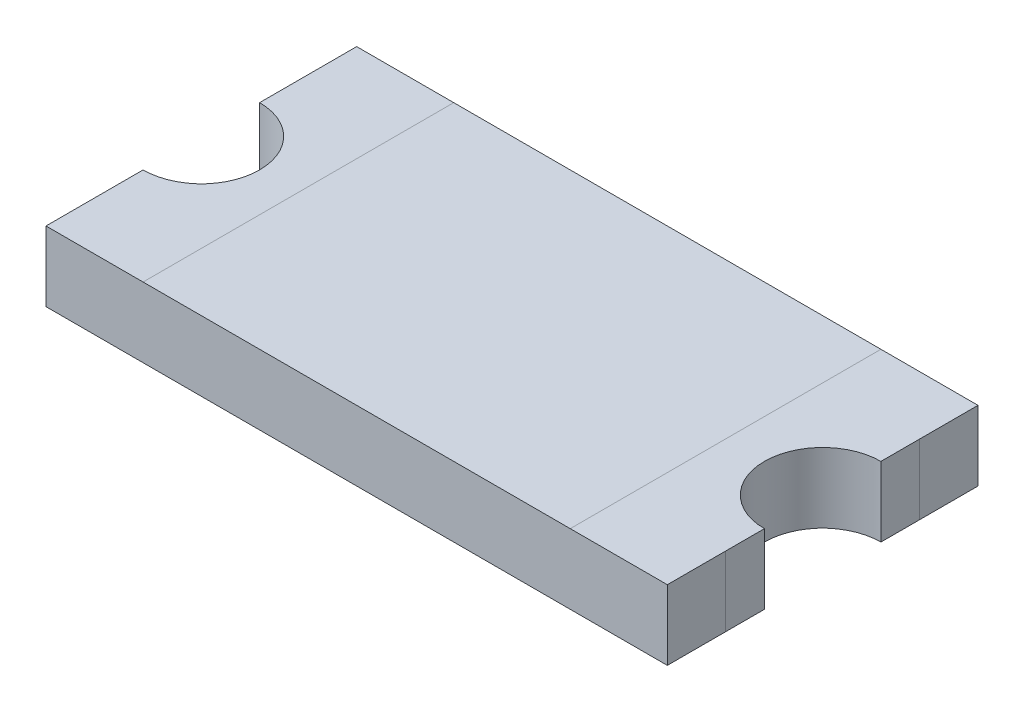
ISO-10303-21;
HEADER;
FILE_DESCRIPTION(('STEP AP214'),'2;1');
FILE_NAME('part.step','',(''),(''),'','','');
FILE_SCHEMA(('AUTOMOTIVE_DESIGN { 1 0 10303 214 1 1 1 1 }'));
ENDSEC;
DATA;
#1=APPLICATION_CONTEXT('core data for automotive mechanical design processes');
#2=APPLICATION_PROTOCOL_DEFINITION('international standard','automotive_design',2000,#1);
#3=PRODUCT_CONTEXT('',#1,'mechanical');
#4=PRODUCT('Part','Part','',(#3));
#5=PRODUCT_RELATED_PRODUCT_CATEGORY('part','',(#4));
#6=PRODUCT_DEFINITION_FORMATION('','',#4);
#7=PRODUCT_DEFINITION_CONTEXT('part definition',#1,'design');
#8=PRODUCT_DEFINITION('design','',#6,#7);
#9=PRODUCT_DEFINITION_SHAPE('','',#8);
#10=(LENGTH_UNIT() NAMED_UNIT(*) SI_UNIT(.MILLI.,.METRE.));
#11=(NAMED_UNIT(*) PLANE_ANGLE_UNIT() SI_UNIT($,.RADIAN.));
#12=(NAMED_UNIT(*) SI_UNIT($,.STERADIAN.) SOLID_ANGLE_UNIT());
#13=UNCERTAINTY_MEASURE_WITH_UNIT(LENGTH_MEASURE(1.E-05),#10,'distance_accuracy_value','');
#14=(GEOMETRIC_REPRESENTATION_CONTEXT(3) GLOBAL_UNCERTAINTY_ASSIGNED_CONTEXT((#13)) GLOBAL_UNIT_ASSIGNED_CONTEXT((#10,
#11,#12)) REPRESENTATION_CONTEXT('',''));
#15=CARTESIAN_POINT('',(0.,0.,0.));
#16=DIRECTION('',(0.,0.,1.));
#17=DIRECTION('',(1.,0.,0.));
#18=AXIS2_PLACEMENT_3D('',#15,#16,#17);
#19=CARTESIAN_POINT('',(-0.8,0.18,-0.15));
#20=DIRECTION('',(1.,0.,0.));
#21=DIRECTION('',(0.,0.707106781186548,0.707106781186548));
#22=AXIS2_PLACEMENT_3D('',#19,#20,#21);
#23=PLANE('',#22);
#24=DIRECTION('',(0.,1.,0.));
#25=VECTOR('',#24,1.);
#26=CARTESIAN_POINT('',(-0.8,0.18,-0.25));
#27=LINE('',#26,#25);
#28=CARTESIAN_POINT('',(-0.8,0.,-0.25));
#29=VERTEX_POINT('',#28);
#30=CARTESIAN_POINT('',(-0.8,0.18,-0.25));
#31=VERTEX_POINT('',#30);
#32=EDGE_CURVE('E34',#29,#31,#27,.T.);
#33=ORIENTED_EDGE('',*,*,#32,.F.);
#34=DIRECTION('',(0.,0.,1.));
#35=VECTOR('',#34,1.);
#36=CARTESIAN_POINT('',(-0.8,0.,-0.15));
#37=LINE('',#36,#35);
#38=CARTESIAN_POINT('',(-0.8,0.,-0.15));
#39=VERTEX_POINT('',#38);
#40=EDGE_CURVE('E11',#29,#39,#37,.T.);
#41=ORIENTED_EDGE('',*,*,#40,.T.);
#42=DIRECTION('',(0.,-1.,0.));
#43=VECTOR('',#42,1.);
#44=CARTESIAN_POINT('',(-0.8,0.18,-0.15));
#45=LINE('',#44,#43);
#46=CARTESIAN_POINT('',(-0.8,0.18,-0.15));
#47=VERTEX_POINT('',#46);
#48=EDGE_CURVE('E212',#47,#39,#45,.T.);
#49=ORIENTED_EDGE('',*,*,#48,.F.);
#50=DIRECTION('',(0.,0.,1.));
#51=VECTOR('',#50,1.);
#52=CARTESIAN_POINT('',(-0.8,0.18,-0.15));
#53=LINE('',#52,#51);
#54=EDGE_CURVE('E305',#31,#47,#53,.T.);
#55=ORIENTED_EDGE('',*,*,#54,.F.);
#56=EDGE_LOOP('',(#33,#41,#49,#55));
#57=FACE_BOUND('',#56,.T.);
#58=ADVANCED_FACE('F16',(#57),#23,.F.);
#59=CARTESIAN_POINT('',(0.8,0.18,-0.15));
#60=DIRECTION('',(-1.,0.,0.));
#61=DIRECTION('',(0.,0.707106781186548,0.707106781186548));
#62=AXIS2_PLACEMENT_3D('',#59,#60,#61);
#63=PLANE('',#62);
#64=DIRECTION('',(0.,-1.,0.));
#65=VECTOR('',#64,1.);
#66=CARTESIAN_POINT('',(0.8,0.18,-0.25));
#67=LINE('',#66,#65);
#68=CARTESIAN_POINT('',(0.8,0.18,-0.25));
#69=VERTEX_POINT('',#68);
#70=CARTESIAN_POINT('',(0.8,0.,-0.25));
#71=VERTEX_POINT('',#70);
#72=EDGE_CURVE('E199',#69,#71,#67,.T.);
#73=ORIENTED_EDGE('',*,*,#72,.F.);
#74=DIRECTION('',(0.,0.,-1.));
#75=VECTOR('',#74,1.);
#76=CARTESIAN_POINT('',(0.8,0.18,-0.15));
#77=LINE('',#76,#75);
#78=CARTESIAN_POINT('',(0.8,0.18,-0.15));
#79=VERTEX_POINT('',#78);
#80=EDGE_CURVE('E204',#79,#69,#77,.T.);
#81=ORIENTED_EDGE('',*,*,#80,.F.);
#82=DIRECTION('',(0.,-1.,0.));
#83=VECTOR('',#82,1.);
#84=CARTESIAN_POINT('',(0.8,0.18,-0.15));
#85=LINE('',#84,#83);
#86=CARTESIAN_POINT('',(0.8,0.,-0.15));
#87=VERTEX_POINT('',#86);
#88=EDGE_CURVE('E26',#79,#87,#85,.T.);
#89=ORIENTED_EDGE('',*,*,#88,.T.);
#90=DIRECTION('',(0.,0.,-1.));
#91=VECTOR('',#90,1.);
#92=CARTESIAN_POINT('',(0.8,0.,-0.15));
#93=LINE('',#92,#91);
#94=EDGE_CURVE('E346',#87,#71,#93,.T.);
#95=ORIENTED_EDGE('',*,*,#94,.T.);
#96=EDGE_LOOP('',(#73,#81,#89,#95));
#97=FACE_BOUND('',#96,.T.);
#98=ADVANCED_FACE('F393',(#97),#63,.F.);
#99=CARTESIAN_POINT('',(-0.8,0.18,0.4));
#100=DIRECTION('',(1.,0.,0.));
#101=DIRECTION('',(0.,0.707106781186548,0.707106781186548));
#102=AXIS2_PLACEMENT_3D('',#99,#100,#101);
#103=PLANE('',#102);
#104=DIRECTION('',(0.,1.,0.));
#105=VECTOR('',#104,1.);
#106=CARTESIAN_POINT('',(-0.8,0.18,0.25));
#107=LINE('',#106,#105);
#108=CARTESIAN_POINT('',(-0.8,0.,0.25));
#109=VERTEX_POINT('',#108);
#110=CARTESIAN_POINT('',(-0.8,0.18,0.25));
#111=VERTEX_POINT('',#110);
#112=EDGE_CURVE('E213',#109,#111,#107,.T.);
#113=ORIENTED_EDGE('',*,*,#112,.F.);
#114=DIRECTION('',(0.,0.,1.));
#115=VECTOR('',#114,1.);
#116=CARTESIAN_POINT('',(-0.8,0.,0.4));
#117=LINE('',#116,#115);
#118=CARTESIAN_POINT('',(-0.8,0.,0.35));
#119=VERTEX_POINT('',#118);
#120=EDGE_CURVE('E343',#109,#119,#117,.T.);
#121=ORIENTED_EDGE('',*,*,#120,.T.);
#122=DIRECTION('',(0.,0.,1.));
#123=VECTOR('',#122,1.);
#124=CARTESIAN_POINT('',(-0.8,0.,0.4));
#125=LINE('',#124,#123);
#126=CARTESIAN_POINT('',(-0.8,0.,0.4));
#127=VERTEX_POINT('',#126);
#128=EDGE_CURVE('E335',#119,#127,#125,.T.);
#129=ORIENTED_EDGE('',*,*,#128,.T.);
#130=DIRECTION('',(0.,-1.,0.));
#131=VECTOR('',#130,1.);
#132=CARTESIAN_POINT('',(-0.8,0.18,0.4));
#133=LINE('',#132,#131);
#134=CARTESIAN_POINT('',(-0.8,0.18,0.4));
#135=VERTEX_POINT('',#134);
#136=EDGE_CURVE('E297',#135,#127,#133,.T.);
#137=ORIENTED_EDGE('',*,*,#136,.F.);
#138=DIRECTION('',(0.,0.,1.));
#139=VECTOR('',#138,1.);
#140=CARTESIAN_POINT('',(-0.8,0.18,0.4));
#141=LINE('',#140,#139);
#142=EDGE_CURVE('E262',#111,#135,#141,.T.);
#143=ORIENTED_EDGE('',*,*,#142,.F.);
#144=EDGE_LOOP('',(#113,#121,#129,#137,#143));
#145=FACE_BOUND('',#144,.T.);
#146=ADVANCED_FACE('F377',(#145),#103,.F.);
#147=CARTESIAN_POINT('',(0.8,0.18,0.4));
#148=DIRECTION('',(-1.,0.,0.));
#149=DIRECTION('',(0.,0.707106781186548,0.707106781186548));
#150=AXIS2_PLACEMENT_3D('',#147,#148,#149);
#151=PLANE('',#150);
#152=DIRECTION('',(0.,-1.,0.));
#153=VECTOR('',#152,1.);
#154=CARTESIAN_POINT('',(0.8,0.18,0.25));
#155=LINE('',#154,#153);
#156=CARTESIAN_POINT('',(0.8,0.18,0.25));
#157=VERTEX_POINT('',#156);
#158=CARTESIAN_POINT('',(0.8,0.,0.25));
#159=VERTEX_POINT('',#158);
#160=EDGE_CURVE('E234',#157,#159,#155,.T.);
#161=ORIENTED_EDGE('',*,*,#160,.F.);
#162=DIRECTION('',(0.,0.,-1.));
#163=VECTOR('',#162,1.);
#164=CARTESIAN_POINT('',(0.8,0.18,0.4));
#165=LINE('',#164,#163);
#166=CARTESIAN_POINT('',(0.8,0.18,0.4));
#167=VERTEX_POINT('',#166);
#168=EDGE_CURVE('E186',#167,#157,#165,.T.);
#169=ORIENTED_EDGE('',*,*,#168,.F.);
#170=DIRECTION('',(0.,-1.,0.));
#171=VECTOR('',#170,1.);
#172=CARTESIAN_POINT('',(0.8,0.18,0.4));
#173=LINE('',#172,#171);
#174=CARTESIAN_POINT('',(0.8,0.,0.4));
#175=VERTEX_POINT('',#174);
#176=EDGE_CURVE('E332',#167,#175,#173,.T.);
#177=ORIENTED_EDGE('',*,*,#176,.T.);
#178=DIRECTION('',(0.,0.,-1.));
#179=VECTOR('',#178,1.);
#180=CARTESIAN_POINT('',(0.8,0.,0.4));
#181=LINE('',#180,#179);
#182=CARTESIAN_POINT('',(0.8,0.,0.35));
#183=VERTEX_POINT('',#182);
#184=EDGE_CURVE('E329',#175,#183,#181,.T.);
#185=ORIENTED_EDGE('',*,*,#184,.T.);
#186=DIRECTION('',(0.,0.,-1.));
#187=VECTOR('',#186,1.);
#188=CARTESIAN_POINT('',(0.8,0.,0.4));
#189=LINE('',#188,#187);
#190=EDGE_CURVE('E326',#183,#159,#189,.T.);
#191=ORIENTED_EDGE('',*,*,#190,.T.);
#192=EDGE_LOOP('',(#161,#169,#177,#185,#191));
#193=FACE_BOUND('',#192,.T.);
#194=ADVANCED_FACE('F402',(#193),#151,.F.);
#195=CARTESIAN_POINT('',(0.8,0.18,0.));
#196=DIRECTION('',(0.,1.,0.));
#197=DIRECTION('',(0.707106781186548,0.,0.707106781186548));
#198=AXIS2_PLACEMENT_3D('',#195,#196,#197);
#199=PLANE('',#198);
#200=DIRECTION('',(1.,0.,0.));
#201=VECTOR('',#200,1.);
#202=CARTESIAN_POINT('',(-0.8,0.18,0.4));
#203=LINE('',#202,#201);
#204=CARTESIAN_POINT('',(-0.55,0.18,0.4));
#205=VERTEX_POINT('',#204);
#206=CARTESIAN_POINT('',(0.55,0.18,0.4));
#207=VERTEX_POINT('',#206);
#208=EDGE_CURVE('E323',#205,#207,#203,.T.);
#209=ORIENTED_EDGE('',*,*,#208,.T.);
#210=DIRECTION('',(0.,0.,-1.));
#211=VECTOR('',#210,1.);
#212=CARTESIAN_POINT('',(0.55,0.18,0.));
#213=LINE('',#212,#211);
#214=CARTESIAN_POINT('',(0.55,0.18,-0.4));
#215=VERTEX_POINT('',#214);
#216=EDGE_CURVE('E320',#207,#215,#213,.T.);
#217=ORIENTED_EDGE('',*,*,#216,.T.);
#218=DIRECTION('',(-1.,0.,0.));
#219=VECTOR('',#218,1.);
#220=CARTESIAN_POINT('',(-0.8,0.18,-0.4));
#221=LINE('',#220,#219);
#222=CARTESIAN_POINT('',(-0.55,0.18,-0.4));
#223=VERTEX_POINT('',#222);
#224=EDGE_CURVE('E316',#215,#223,#221,.T.);
#225=ORIENTED_EDGE('',*,*,#224,.T.);
#226=DIRECTION('',(0.,0.,-1.));
#227=VECTOR('',#226,1.);
#228=CARTESIAN_POINT('',(-0.55,0.18,0.));
#229=LINE('',#228,#227);
#230=EDGE_CURVE('E312',#205,#223,#229,.T.);
#231=ORIENTED_EDGE('',*,*,#230,.F.);
#232=EDGE_LOOP('',(#209,#217,#225,#231));
#233=FACE_BOUND('',#232,.T.);
#234=ADVANCED_FACE('F385',(#233),#199,.T.);
#235=CARTESIAN_POINT('',(0.8,0.18,0.));
#236=DIRECTION('',(0.,1.,0.));
#237=DIRECTION('',(0.707106781186548,0.,0.707106781186548));
#238=AXIS2_PLACEMENT_3D('',#235,#236,#237);
#239=PLANE('',#238);
#240=DIRECTION('',(1.,0.,0.));
#241=VECTOR('',#240,1.);
#242=CARTESIAN_POINT('',(-0.8,0.18,0.4));
#243=LINE('',#242,#241);
#244=EDGE_CURVE('E313',#135,#205,#243,.T.);
#245=ORIENTED_EDGE('',*,*,#244,.T.);
#246=ORIENTED_EDGE('',*,*,#230,.T.);
#247=DIRECTION('',(-1.,0.,0.));
#248=VECTOR('',#247,1.);
#249=CARTESIAN_POINT('',(-0.8,0.18,-0.4));
#250=LINE('',#249,#248);
#251=CARTESIAN_POINT('',(-0.8,0.18,-0.4));
#252=VERTEX_POINT('',#251);
#253=EDGE_CURVE('E309',#223,#252,#250,.T.);
#254=ORIENTED_EDGE('',*,*,#253,.T.);
#255=DIRECTION('',(0.,0.,1.));
#256=VECTOR('',#255,1.);
#257=CARTESIAN_POINT('',(-0.8,0.18,-0.15));
#258=LINE('',#257,#256);
#259=EDGE_CURVE('E306',#252,#31,#258,.T.);
#260=ORIENTED_EDGE('',*,*,#259,.T.);
#261=ORIENTED_EDGE('',*,*,#54,.T.);
#262=CARTESIAN_POINT('',(-0.8,0.18,0.));
#263=DIRECTION('',(0.,-1.,0.));
#264=DIRECTION('',(0.,0.,1.));
#265=AXIS2_PLACEMENT_3D('',#262,#263,#264);
#266=CIRCLE('',#265,0.15);
#267=CARTESIAN_POINT('',(-0.8,0.18,0.15));
#268=VERTEX_POINT('',#267);
#269=EDGE_CURVE('E302',#47,#268,#266,.T.);
#270=ORIENTED_EDGE('',*,*,#269,.T.);
#271=DIRECTION('',(0.,0.,1.));
#272=VECTOR('',#271,1.);
#273=CARTESIAN_POINT('',(-0.8,0.18,0.4));
#274=LINE('',#273,#272);
#275=EDGE_CURVE('E299',#268,#111,#274,.T.);
#276=ORIENTED_EDGE('',*,*,#275,.T.);
#277=ORIENTED_EDGE('',*,*,#142,.T.);
#278=EDGE_LOOP('',(#245,#246,#254,#260,#261,#270,#276,#277));
#279=FACE_BOUND('',#278,.T.);
#280=ADVANCED_FACE('F360',(#279),#239,.T.);
#281=CARTESIAN_POINT('',(0.8,0.,0.));
#282=DIRECTION('',(0.,1.,0.));
#283=DIRECTION('',(0.707106781186548,0.,0.707106781186548));
#284=AXIS2_PLACEMENT_3D('',#281,#282,#283);
#285=PLANE('',#284);
#286=DIRECTION('',(-1.,0.,0.));
#287=VECTOR('',#286,1.);
#288=CARTESIAN_POINT('',(0.8,0.,0.35));
#289=LINE('',#288,#287);
#290=CARTESIAN_POINT('',(0.4,0.,0.35));
#291=VERTEX_POINT('',#290);
#292=EDGE_CURVE('E258',#183,#291,#289,.T.);
#293=ORIENTED_EDGE('',*,*,#292,.F.);
#294=ORIENTED_EDGE('',*,*,#184,.F.);
#295=DIRECTION('',(1.,0.,0.));
#296=VECTOR('',#295,1.);
#297=CARTESIAN_POINT('',(-0.8,0.,0.4));
#298=LINE('',#297,#296);
#299=EDGE_CURVE('E215',#127,#175,#298,.T.);
#300=ORIENTED_EDGE('',*,*,#299,.F.);
#301=ORIENTED_EDGE('',*,*,#128,.F.);
#302=DIRECTION('',(-1.,0.,0.));
#303=VECTOR('',#302,1.);
#304=CARTESIAN_POINT('',(0.8,0.,0.35));
#305=LINE('',#304,#303);
#306=CARTESIAN_POINT('',(-0.4,0.,0.35));
#307=VERTEX_POINT('',#306);
#308=EDGE_CURVE('E292',#307,#119,#305,.T.);
#309=ORIENTED_EDGE('',*,*,#308,.F.);
#310=DIRECTION('',(0.,0.,1.));
#311=VECTOR('',#310,1.);
#312=CARTESIAN_POINT('',(-0.4,0.,0.));
#313=LINE('',#312,#311);
#314=CARTESIAN_POINT('',(-0.4,0.,-0.35));
#315=VERTEX_POINT('',#314);
#316=EDGE_CURVE('E289',#315,#307,#313,.T.);
#317=ORIENTED_EDGE('',*,*,#316,.F.);
#318=DIRECTION('',(1.,0.,0.));
#319=VECTOR('',#318,1.);
#320=CARTESIAN_POINT('',(0.8,0.,-0.35));
#321=LINE('',#320,#319);
#322=CARTESIAN_POINT('',(-0.8,0.,-0.35));
#323=VERTEX_POINT('',#322);
#324=EDGE_CURVE('E229',#323,#315,#321,.T.);
#325=ORIENTED_EDGE('',*,*,#324,.F.);
#326=DIRECTION('',(0.,0.,1.));
#327=VECTOR('',#326,1.);
#328=CARTESIAN_POINT('',(-0.8,0.,-0.15));
#329=LINE('',#328,#327);
#330=CARTESIAN_POINT('',(-0.8,0.,-0.4));
#331=VERTEX_POINT('',#330);
#332=EDGE_CURVE('E218',#331,#323,#329,.T.);
#333=ORIENTED_EDGE('',*,*,#332,.F.);
#334=DIRECTION('',(-1.,0.,0.));
#335=VECTOR('',#334,1.);
#336=CARTESIAN_POINT('',(-0.8,0.,-0.4));
#337=LINE('',#336,#335);
#338=CARTESIAN_POINT('',(0.8,0.,-0.4));
#339=VERTEX_POINT('',#338);
#340=EDGE_CURVE('E225',#339,#331,#337,.T.);
#341=ORIENTED_EDGE('',*,*,#340,.F.);
#342=DIRECTION('',(0.,0.,-1.));
#343=VECTOR('',#342,1.);
#344=CARTESIAN_POINT('',(0.8,0.,-0.15));
#345=LINE('',#344,#343);
#346=CARTESIAN_POINT('',(0.8,0.,-0.35));
#347=VERTEX_POINT('',#346);
#348=EDGE_CURVE('E209',#347,#339,#345,.T.);
#349=ORIENTED_EDGE('',*,*,#348,.F.);
#350=DIRECTION('',(1.,0.,0.));
#351=VECTOR('',#350,1.);
#352=CARTESIAN_POINT('',(0.8,0.,-0.35));
#353=LINE('',#352,#351);
#354=CARTESIAN_POINT('',(0.4,0.,-0.35));
#355=VERTEX_POINT('',#354);
#356=EDGE_CURVE('E279',#355,#347,#353,.T.);
#357=ORIENTED_EDGE('',*,*,#356,.F.);
#358=DIRECTION('',(0.,0.,-1.));
#359=VECTOR('',#358,1.);
#360=CARTESIAN_POINT('',(0.4,0.,0.));
#361=LINE('',#360,#359);
#362=CARTESIAN_POINT('',(0.4,0.,-0.15));
#363=VERTEX_POINT('',#362);
#364=EDGE_CURVE('E276',#363,#355,#361,.T.);
#365=ORIENTED_EDGE('',*,*,#364,.F.);
#366=DIRECTION('',(1.,0.,0.));
#367=VECTOR('',#366,1.);
#368=CARTESIAN_POINT('',(0.8,0.,-0.15));
#369=LINE('',#368,#367);
#370=CARTESIAN_POINT('',(0.1,0.,-0.15));
#371=VERTEX_POINT('',#370);
#372=EDGE_CURVE('E273',#371,#363,#369,.T.);
#373=ORIENTED_EDGE('',*,*,#372,.F.);
#374=DIRECTION('',(0.,0.,-1.));
#375=VECTOR('',#374,1.);
#376=CARTESIAN_POINT('',(0.1,0.,0.));
#377=LINE('',#376,#375);
#378=CARTESIAN_POINT('',(0.1,0.,0.15));
#379=VERTEX_POINT('',#378);
#380=EDGE_CURVE('E270',#379,#371,#377,.T.);
#381=ORIENTED_EDGE('',*,*,#380,.F.);
#382=DIRECTION('',(-1.,0.,0.));
#383=VECTOR('',#382,1.);
#384=CARTESIAN_POINT('',(0.8,0.,0.15));
#385=LINE('',#384,#383);
#386=CARTESIAN_POINT('',(0.4,0.,0.15));
#387=VERTEX_POINT('',#386);
#388=EDGE_CURVE('E267',#387,#379,#385,.T.);
#389=ORIENTED_EDGE('',*,*,#388,.F.);
#390=DIRECTION('',(0.,0.,-1.));
#391=VECTOR('',#390,1.);
#392=CARTESIAN_POINT('',(0.4,0.,0.));
#393=LINE('',#392,#391);
#394=EDGE_CURVE('E264',#291,#387,#393,.T.);
#395=ORIENTED_EDGE('',*,*,#394,.F.);
#396=EDGE_LOOP('',(#293,#294,#300,#301,#309,#317,#325,#333,#341,#349,#357,#365,#373,#381,#389,#395));
#397=FACE_BOUND('',#396,.T.);
#398=DIRECTION('',(-1.,0.,0.));
#399=VECTOR('',#398,1.);
#400=CARTESIAN_POINT('',(0.8,0.,0.3));
#401=LINE('',#400,#399);
#402=CARTESIAN_POINT('',(-0.1875,0.,0.3));
#403=VERTEX_POINT('',#402);
#404=CARTESIAN_POINT('',(-0.3125,0.,0.3));
#405=VERTEX_POINT('',#404);
#406=EDGE_CURVE('E242',#403,#405,#401,.T.);
#407=ORIENTED_EDGE('',*,*,#406,.F.);
#408=DIRECTION('',(0.,0.,1.));
#409=VECTOR('',#408,1.);
#410=CARTESIAN_POINT('',(-0.1875,0.,0.));
#411=LINE('',#410,#409);
#412=CARTESIAN_POINT('',(-0.1875,0.,0.0625));
#413=VERTEX_POINT('',#412);
#414=EDGE_CURVE('E259',#413,#403,#411,.T.);
#415=ORIENTED_EDGE('',*,*,#414,.F.);
#416=DIRECTION('',(-1.,0.,0.));
#417=VECTOR('',#416,1.);
#418=CARTESIAN_POINT('',(0.8,0.,0.0625));
#419=LINE('',#418,#417);
#420=CARTESIAN_POINT('',(0.0125000000000001,0.,0.0625));
#421=VERTEX_POINT('',#420);
#422=EDGE_CURVE('E255',#421,#413,#419,.T.);
#423=ORIENTED_EDGE('',*,*,#422,.F.);
#424=DIRECTION('',(0.,0.,1.));
#425=VECTOR('',#424,1.);
#426=CARTESIAN_POINT('',(0.0125000000000001,0.,0.));
#427=LINE('',#426,#425);
#428=CARTESIAN_POINT('',(0.0125000000000002,0.,-0.0625));
#429=VERTEX_POINT('',#428);
#430=EDGE_CURVE('E252',#429,#421,#427,.T.);
#431=ORIENTED_EDGE('',*,*,#430,.F.);
#432=DIRECTION('',(1.,0.,0.));
#433=VECTOR('',#432,1.);
#434=CARTESIAN_POINT('',(0.8,0.,-0.0625));
#435=LINE('',#434,#433);
#436=CARTESIAN_POINT('',(-0.1875,0.,-0.0625));
#437=VERTEX_POINT('',#436);
#438=EDGE_CURVE('E249',#437,#429,#435,.T.);
#439=ORIENTED_EDGE('',*,*,#438,.F.);
#440=DIRECTION('',(0.,0.,1.));
#441=VECTOR('',#440,1.);
#442=CARTESIAN_POINT('',(-0.1875,0.,0.));
#443=LINE('',#442,#441);
#444=CARTESIAN_POINT('',(-0.1875,0.,-0.3));
#445=VERTEX_POINT('',#444);
#446=EDGE_CURVE('E246',#445,#437,#443,.T.);
#447=ORIENTED_EDGE('',*,*,#446,.F.);
#448=DIRECTION('',(1.,0.,0.));
#449=VECTOR('',#448,1.);
#450=CARTESIAN_POINT('',(0.8,0.,-0.3));
#451=LINE('',#450,#449);
#452=CARTESIAN_POINT('',(-0.3125,0.,-0.3));
#453=VERTEX_POINT('',#452);
#454=EDGE_CURVE('E243',#453,#445,#451,.T.);
#455=ORIENTED_EDGE('',*,*,#454,.F.);
#456=DIRECTION('',(0.,0.,-1.));
#457=VECTOR('',#456,1.);
#458=CARTESIAN_POINT('',(-0.3125,0.,0.));
#459=LINE('',#458,#457);
#460=EDGE_CURVE('E239',#405,#453,#459,.T.);
#461=ORIENTED_EDGE('',*,*,#460,.F.);
#462=EDGE_LOOP('',(#407,#415,#423,#431,#439,#447,#455,#461));
#463=FACE_BOUND('',#462,.T.);
#464=ADVANCED_FACE('F398',(#397,#463),#285,.F.);
#465=CARTESIAN_POINT('',(0.8,0.,0.));
#466=DIRECTION('',(0.,1.,0.));
#467=DIRECTION('',(0.707106781186548,0.,0.707106781186548));
#468=AXIS2_PLACEMENT_3D('',#465,#466,#467);
#469=PLANE('',#468);
#470=ORIENTED_EDGE('',*,*,#414,.T.);
#471=ORIENTED_EDGE('',*,*,#406,.T.);
#472=ORIENTED_EDGE('',*,*,#460,.T.);
#473=ORIENTED_EDGE('',*,*,#454,.T.);
#474=ORIENTED_EDGE('',*,*,#446,.T.);
#475=ORIENTED_EDGE('',*,*,#438,.T.);
#476=ORIENTED_EDGE('',*,*,#430,.T.);
#477=ORIENTED_EDGE('',*,*,#422,.T.);
#478=EDGE_LOOP('',(#470,#471,#472,#473,#474,#475,#476,#477));
#479=FACE_BOUND('',#478,.T.);
#480=ADVANCED_FACE('F458',(#479),#469,.F.);
#481=CARTESIAN_POINT('',(0.8,0.,0.));
#482=DIRECTION('',(0.,1.,0.));
#483=DIRECTION('',(0.707106781186548,0.,0.707106781186548));
#484=AXIS2_PLACEMENT_3D('',#481,#482,#483);
#485=PLANE('',#484);
#486=ORIENTED_EDGE('',*,*,#190,.F.);
#487=ORIENTED_EDGE('',*,*,#292,.T.);
#488=ORIENTED_EDGE('',*,*,#394,.T.);
#489=ORIENTED_EDGE('',*,*,#388,.T.);
#490=ORIENTED_EDGE('',*,*,#380,.T.);
#491=ORIENTED_EDGE('',*,*,#372,.T.);
#492=ORIENTED_EDGE('',*,*,#364,.T.);
#493=ORIENTED_EDGE('',*,*,#356,.T.);
#494=DIRECTION('',(0.,0.,-1.));
#495=VECTOR('',#494,1.);
#496=CARTESIAN_POINT('',(0.8,0.,-0.15));
#497=LINE('',#496,#495);
#498=EDGE_CURVE('E236',#71,#347,#497,.T.);
#499=ORIENTED_EDGE('',*,*,#498,.F.);
#500=ORIENTED_EDGE('',*,*,#94,.F.);
#501=CARTESIAN_POINT('',(0.8,0.,0.));
#502=DIRECTION('',(0.,-1.,0.));
#503=DIRECTION('',(0.,0.,1.));
#504=AXIS2_PLACEMENT_3D('',#501,#502,#503);
#505=CIRCLE('',#504,0.15);
#506=CARTESIAN_POINT('',(0.8,0.,0.15));
#507=VERTEX_POINT('',#506);
#508=EDGE_CURVE('E198',#507,#87,#505,.T.);
#509=ORIENTED_EDGE('',*,*,#508,.F.);
#510=DIRECTION('',(0.,0.,-1.));
#511=VECTOR('',#510,1.);
#512=CARTESIAN_POINT('',(0.8,0.,0.4));
#513=LINE('',#512,#511);
#514=EDGE_CURVE('E195',#159,#507,#513,.T.);
#515=ORIENTED_EDGE('',*,*,#514,.F.);
#516=EDGE_LOOP('',(#486,#487,#488,#489,#490,#491,#492,#493,#499,#500,#509,#515));
#517=FACE_BOUND('',#516,.T.);
#518=ADVANCED_FACE('F396',(#517),#485,.F.);
#519=CARTESIAN_POINT('',(-0.8,0.18,-0.4));
#520=DIRECTION('',(0.,0.,1.));
#521=DIRECTION('',(0.707106781186548,0.707106781186548,0.));
#522=AXIS2_PLACEMENT_3D('',#519,#520,#521);
#523=PLANE('',#522);
#524=ORIENTED_EDGE('',*,*,#340,.T.);
#525=DIRECTION('',(0.,-1.,0.));
#526=VECTOR('',#525,1.);
#527=CARTESIAN_POINT('',(-0.8,0.18,-0.4));
#528=LINE('',#527,#526);
#529=EDGE_CURVE('E230',#252,#331,#528,.T.);
#530=ORIENTED_EDGE('',*,*,#529,.F.);
#531=ORIENTED_EDGE('',*,*,#253,.F.);
#532=ORIENTED_EDGE('',*,*,#224,.F.);
#533=DIRECTION('',(-1.,0.,0.));
#534=VECTOR('',#533,1.);
#535=CARTESIAN_POINT('',(-0.8,0.18,-0.4));
#536=LINE('',#535,#534);
#537=CARTESIAN_POINT('',(0.8,0.18,-0.4));
#538=VERTEX_POINT('',#537);
#539=EDGE_CURVE('E226',#538,#215,#536,.T.);
#540=ORIENTED_EDGE('',*,*,#539,.F.);
#541=DIRECTION('',(0.,-1.,0.));
#542=VECTOR('',#541,1.);
#543=CARTESIAN_POINT('',(0.8,0.18,-0.4));
#544=LINE('',#543,#542);
#545=EDGE_CURVE('E222',#538,#339,#544,.T.);
#546=ORIENTED_EDGE('',*,*,#545,.T.);
#547=EDGE_LOOP('',(#524,#530,#531,#532,#540,#546));
#548=FACE_BOUND('',#547,.T.);
#549=ADVANCED_FACE('F364',(#548),#523,.F.);
#550=CARTESIAN_POINT('',(-0.8,0.18,-0.15));
#551=DIRECTION('',(1.,0.,0.));
#552=DIRECTION('',(0.,0.707106781186548,0.707106781186548));
#553=AXIS2_PLACEMENT_3D('',#550,#551,#552);
#554=PLANE('',#553);
#555=DIRECTION('',(0.,0.,1.));
#556=VECTOR('',#555,1.);
#557=CARTESIAN_POINT('',(-0.8,0.,-0.15));
#558=LINE('',#557,#556);
#559=EDGE_CURVE('E219',#323,#29,#558,.T.);
#560=ORIENTED_EDGE('',*,*,#559,.T.);
#561=ORIENTED_EDGE('',*,*,#32,.T.);
#562=ORIENTED_EDGE('',*,*,#259,.F.);
#563=ORIENTED_EDGE('',*,*,#529,.T.);
#564=ORIENTED_EDGE('',*,*,#332,.T.);
#565=EDGE_LOOP('',(#560,#561,#562,#563,#564));
#566=FACE_BOUND('',#565,.T.);
#567=ADVANCED_FACE('F356',(#566),#554,.F.);
#568=CARTESIAN_POINT('',(-0.8,0.18,0.));
#569=DIRECTION('',(0.,-1.,0.));
#570=DIRECTION('',(0.,0.,-1.));
#571=AXIS2_PLACEMENT_3D('',#568,#569,#570);
#572=CYLINDRICAL_SURFACE('',#571,0.15);
#573=CARTESIAN_POINT('',(-0.8,0.,0.));
#574=DIRECTION('',(0.,-1.,0.));
#575=DIRECTION('',(0.,0.,1.));
#576=AXIS2_PLACEMENT_3D('',#573,#574,#575);
#577=CIRCLE('',#576,0.15);
#578=CARTESIAN_POINT('',(-0.8,0.,0.15));
#579=VERTEX_POINT('',#578);
#580=EDGE_CURVE('E216',#39,#579,#577,.T.);
#581=ORIENTED_EDGE('',*,*,#580,.T.);
#582=DIRECTION('',(0.,-1.,0.));
#583=VECTOR('',#582,1.);
#584=CARTESIAN_POINT('',(-0.8,0.18,0.15));
#585=LINE('',#584,#583);
#586=EDGE_CURVE('E174',#268,#579,#585,.T.);
#587=ORIENTED_EDGE('',*,*,#586,.F.);
#588=ORIENTED_EDGE('',*,*,#269,.F.);
#589=ORIENTED_EDGE('',*,*,#48,.T.);
#590=EDGE_LOOP('',(#581,#587,#588,#589));
#591=FACE_BOUND('',#590,.T.);
#592=ADVANCED_FACE('F372',(#591),#572,.F.);
#593=CARTESIAN_POINT('',(-0.8,0.18,0.4));
#594=DIRECTION('',(1.,0.,0.));
#595=DIRECTION('',(0.,0.707106781186548,0.707106781186548));
#596=AXIS2_PLACEMENT_3D('',#593,#594,#595);
#597=PLANE('',#596);
#598=DIRECTION('',(0.,0.,1.));
#599=VECTOR('',#598,1.);
#600=CARTESIAN_POINT('',(-0.8,0.,0.4));
#601=LINE('',#600,#599);
#602=EDGE_CURVE('E210',#579,#109,#601,.T.);
#603=ORIENTED_EDGE('',*,*,#602,.T.);
#604=ORIENTED_EDGE('',*,*,#112,.T.);
#605=ORIENTED_EDGE('',*,*,#275,.F.);
#606=ORIENTED_EDGE('',*,*,#586,.T.);
#607=EDGE_LOOP('',(#603,#604,#605,#606));
#608=FACE_BOUND('',#607,.T.);
#609=ADVANCED_FACE('F375',(#608),#597,.F.);
#610=CARTESIAN_POINT('',(-0.8,0.18,0.4));
#611=DIRECTION('',(0.,0.,-1.));
#612=DIRECTION('',(0.707106781186548,0.707106781186548,0.));
#613=AXIS2_PLACEMENT_3D('',#610,#611,#612);
#614=PLANE('',#613);
#615=ORIENTED_EDGE('',*,*,#299,.T.);
#616=ORIENTED_EDGE('',*,*,#176,.F.);
#617=DIRECTION('',(1.,0.,0.));
#618=VECTOR('',#617,1.);
#619=CARTESIAN_POINT('',(-0.8,0.18,0.4));
#620=LINE('',#619,#618);
#621=EDGE_CURVE('E207',#207,#167,#620,.T.);
#622=ORIENTED_EDGE('',*,*,#621,.F.);
#623=ORIENTED_EDGE('',*,*,#208,.F.);
#624=ORIENTED_EDGE('',*,*,#244,.F.);
#625=ORIENTED_EDGE('',*,*,#136,.T.);
#626=EDGE_LOOP('',(#615,#616,#622,#623,#624,#625));
#627=FACE_BOUND('',#626,.T.);
#628=ADVANCED_FACE('F380',(#627),#614,.F.);
#629=CARTESIAN_POINT('',(0.8,0.18,0.4));
#630=DIRECTION('',(-1.,0.,0.));
#631=DIRECTION('',(0.,0.707106781186548,0.707106781186548));
#632=AXIS2_PLACEMENT_3D('',#629,#630,#631);
#633=PLANE('',#632);
#634=DIRECTION('',(0.,0.,-1.));
#635=VECTOR('',#634,1.);
#636=CARTESIAN_POINT('',(0.8,0.18,0.4));
#637=LINE('',#636,#635);
#638=CARTESIAN_POINT('',(0.8,0.18,0.15));
#639=VERTEX_POINT('',#638);
#640=EDGE_CURVE('E180',#157,#639,#637,.T.);
#641=ORIENTED_EDGE('',*,*,#640,.F.);
#642=ORIENTED_EDGE('',*,*,#160,.T.);
#643=ORIENTED_EDGE('',*,*,#514,.T.);
#644=DIRECTION('',(0.,-1.,0.));
#645=VECTOR('',#644,1.);
#646=CARTESIAN_POINT('',(0.8,0.18,0.15));
#647=LINE('',#646,#645);
#648=EDGE_CURVE('E192',#639,#507,#647,.T.);
#649=ORIENTED_EDGE('',*,*,#648,.F.);
#650=EDGE_LOOP('',(#641,#642,#643,#649));
#651=FACE_BOUND('',#650,.T.);
#652=ADVANCED_FACE('F193',(#651),#633,.F.);
#653=CARTESIAN_POINT('',(0.8,0.18,0.));
#654=DIRECTION('',(0.,-1.,0.));
#655=DIRECTION('',(0.,0.,-1.));
#656=AXIS2_PLACEMENT_3D('',#653,#654,#655);
#657=CYLINDRICAL_SURFACE('',#656,0.15);
#658=ORIENTED_EDGE('',*,*,#508,.T.);
#659=ORIENTED_EDGE('',*,*,#88,.F.);
#660=CARTESIAN_POINT('',(0.8,0.18,0.));
#661=DIRECTION('',(0.,-1.,0.));
#662=DIRECTION('',(0.,0.,1.));
#663=AXIS2_PLACEMENT_3D('',#660,#661,#662);
#664=CIRCLE('',#663,0.15);
#665=EDGE_CURVE('E184',#639,#79,#664,.T.);
#666=ORIENTED_EDGE('',*,*,#665,.F.);
#667=ORIENTED_EDGE('',*,*,#648,.T.);
#668=EDGE_LOOP('',(#658,#659,#666,#667));
#669=FACE_BOUND('',#668,.T.);
#670=ADVANCED_FACE('F202',(#669),#657,.F.);
#671=CARTESIAN_POINT('',(0.8,0.18,-0.15));
#672=DIRECTION('',(-1.,0.,0.));
#673=DIRECTION('',(0.,0.707106781186548,0.707106781186548));
#674=AXIS2_PLACEMENT_3D('',#671,#672,#673);
#675=PLANE('',#674);
#676=DIRECTION('',(0.,0.,-1.));
#677=VECTOR('',#676,1.);
#678=CARTESIAN_POINT('',(0.8,0.18,-0.15));
#679=LINE('',#678,#677);
#680=EDGE_CURVE('E20',#69,#538,#679,.T.);
#681=ORIENTED_EDGE('',*,*,#680,.F.);
#682=ORIENTED_EDGE('',*,*,#72,.T.);
#683=ORIENTED_EDGE('',*,*,#498,.T.);
#684=ORIENTED_EDGE('',*,*,#348,.T.);
#685=ORIENTED_EDGE('',*,*,#545,.F.);
#686=EDGE_LOOP('',(#681,#682,#683,#684,#685));
#687=FACE_BOUND('',#686,.T.);
#688=ADVANCED_FACE('F390',(#687),#675,.F.);
#689=CARTESIAN_POINT('',(0.8,0.18,0.));
#690=DIRECTION('',(0.,1.,0.));
#691=DIRECTION('',(0.707106781186548,0.,0.707106781186548));
#692=AXIS2_PLACEMENT_3D('',#689,#690,#691);
#693=PLANE('',#692);
#694=ORIENTED_EDGE('',*,*,#216,.F.);
#695=ORIENTED_EDGE('',*,*,#621,.T.);
#696=ORIENTED_EDGE('',*,*,#168,.T.);
#697=ORIENTED_EDGE('',*,*,#640,.T.);
#698=ORIENTED_EDGE('',*,*,#665,.T.);
#699=ORIENTED_EDGE('',*,*,#80,.T.);
#700=ORIENTED_EDGE('',*,*,#680,.T.);
#701=ORIENTED_EDGE('',*,*,#539,.T.);
#702=EDGE_LOOP('',(#694,#695,#696,#697,#698,#699,#700,#701));
#703=FACE_BOUND('',#702,.T.);
#704=ADVANCED_FACE('F182',(#703),#693,.T.);
#705=CARTESIAN_POINT('',(0.8,0.,0.));
#706=DIRECTION('',(0.,1.,0.));
#707=DIRECTION('',(0.707106781186548,0.,0.707106781186548));
#708=AXIS2_PLACEMENT_3D('',#705,#706,#707);
#709=PLANE('',#708);
#710=ORIENTED_EDGE('',*,*,#559,.F.);
#711=ORIENTED_EDGE('',*,*,#324,.T.);
#712=ORIENTED_EDGE('',*,*,#316,.T.);
#713=ORIENTED_EDGE('',*,*,#308,.T.);
#714=ORIENTED_EDGE('',*,*,#120,.F.);
#715=ORIENTED_EDGE('',*,*,#602,.F.);
#716=ORIENTED_EDGE('',*,*,#580,.F.);
#717=ORIENTED_EDGE('',*,*,#40,.F.);
#718=EDGE_LOOP('',(#710,#711,#712,#713,#714,#715,#716,#717));
#719=FACE_BOUND('',#718,.T.);
#720=ADVANCED_FACE('F18',(#719),#709,.F.);
#721=CLOSED_SHELL('',(#58,#98,#146,#194,#234,#280,#464,#480,#518,#549,#567,#592,#609,#628,#652,
#670,#688,#704,#720));
#722=MANIFOLD_SOLID_BREP('B1',#721);
#723=ADVANCED_BREP_SHAPE_REPRESENTATION('',(#18,#722),#14);
#724=SHAPE_DEFINITION_REPRESENTATION(#9,#723);
ENDSEC;
END-ISO-10303-21;
